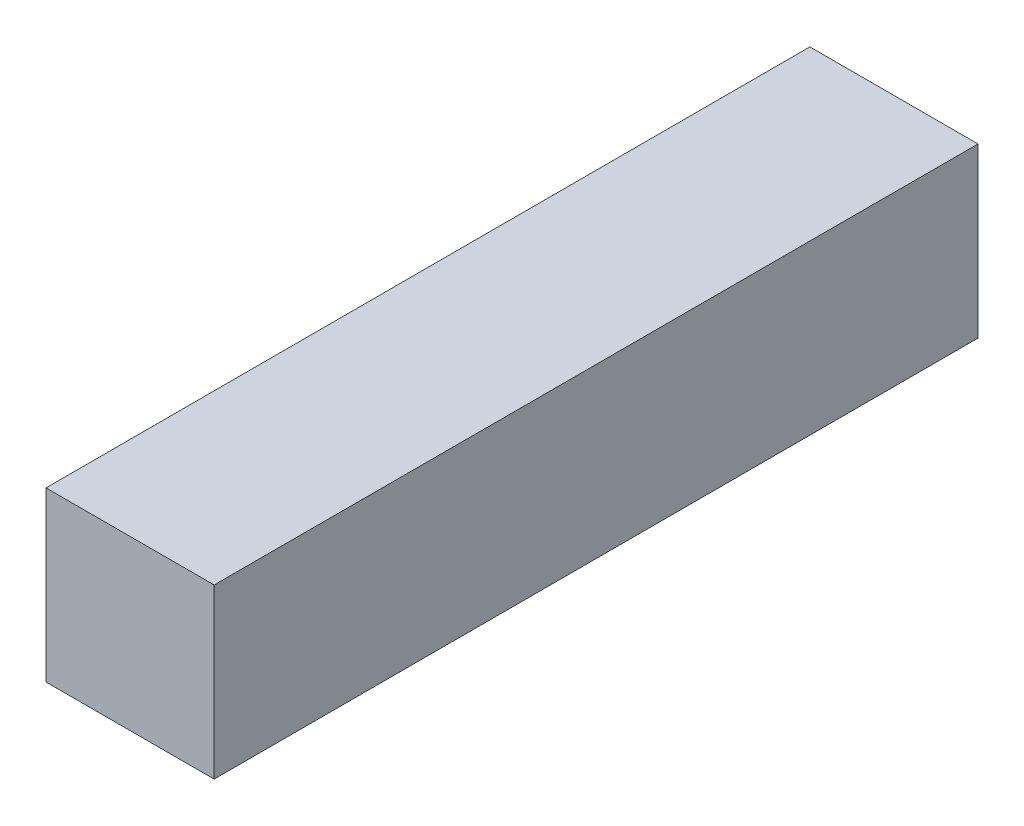
ISO-10303-21;
HEADER;
FILE_DESCRIPTION(('STEP AP214'),'2;1');
FILE_NAME('part.step','',(''),(''),'','','');
FILE_SCHEMA(('AUTOMOTIVE_DESIGN { 1 0 10303 214 1 1 1 1 }'));
ENDSEC;
DATA;
#1=APPLICATION_CONTEXT('core data for automotive mechanical design processes');
#2=APPLICATION_PROTOCOL_DEFINITION('international standard','automotive_design',2000,#1);
#3=PRODUCT_CONTEXT('',#1,'mechanical');
#4=PRODUCT('Part','Part','',(#3));
#5=PRODUCT_RELATED_PRODUCT_CATEGORY('part','',(#4));
#6=PRODUCT_DEFINITION_FORMATION('','',#4);
#7=PRODUCT_DEFINITION_CONTEXT('part definition',#1,'design');
#8=PRODUCT_DEFINITION('design','',#6,#7);
#9=PRODUCT_DEFINITION_SHAPE('','',#8);
#10=(LENGTH_UNIT() NAMED_UNIT(*) SI_UNIT(.MILLI.,.METRE.));
#11=(NAMED_UNIT(*) PLANE_ANGLE_UNIT() SI_UNIT($,.RADIAN.));
#12=(NAMED_UNIT(*) SI_UNIT($,.STERADIAN.) SOLID_ANGLE_UNIT());
#13=UNCERTAINTY_MEASURE_WITH_UNIT(LENGTH_MEASURE(1.E-05),#10,'distance_accuracy_value','');
#14=(GEOMETRIC_REPRESENTATION_CONTEXT(3) GLOBAL_UNCERTAINTY_ASSIGNED_CONTEXT((#13)) GLOBAL_UNIT_ASSIGNED_CONTEXT((#10,
#11,#12)) REPRESENTATION_CONTEXT('',''));
#15=CARTESIAN_POINT('',(0.,0.,0.));
#16=DIRECTION('',(0.,0.,1.));
#17=DIRECTION('',(1.,0.,0.));
#18=AXIS2_PLACEMENT_3D('',#15,#16,#17);
#19=CARTESIAN_POINT('',(-6.99999999998829,7.0000000000016,-41.6994949366046));
#20=DIRECTION('',(-1.,0.,0.));
#21=DIRECTION('',(0.,0.,1.));
#22=AXIS2_PLACEMENT_3D('',#19,#20,#21);
#23=PLANE('',#22);
#24=DIRECTION('',(0.,1.,0.));
#25=VECTOR('',#24,1.);
#26=CARTESIAN_POINT('',(-6.99999999998829,7.0000000000016,-31.8));
#27=LINE('',#26,#25);
#28=CARTESIAN_POINT('',(-6.99999999998829,0.,-31.8));
#29=VERTEX_POINT('',#28);
#30=CARTESIAN_POINT('',(-6.99999999998829,7.0000000000016,-31.8));
#31=VERTEX_POINT('',#30);
#32=EDGE_CURVE('E43',#29,#31,#27,.T.);
#33=ORIENTED_EDGE('',*,*,#32,.F.);
#34=DIRECTION('',(0.,0.,1.));
#35=VECTOR('',#34,1.);
#36=CARTESIAN_POINT('',(-6.99999999998829,0.,-41.6994949366046));
#37=LINE('',#36,#35);
#38=CARTESIAN_POINT('',(-6.99999999998829,0.,0.));
#39=VERTEX_POINT('',#38);
#40=EDGE_CURVE('E71',#29,#39,#37,.T.);
#41=ORIENTED_EDGE('',*,*,#40,.T.);
#42=DIRECTION('',(0.,-1.,0.));
#43=VECTOR('',#42,1.);
#44=CARTESIAN_POINT('',(-6.99999999998829,7.0000000000016,0.));
#45=LINE('',#44,#43);
#46=CARTESIAN_POINT('',(-6.99999999998829,7.0000000000016,0.));
#47=VERTEX_POINT('',#46);
#48=EDGE_CURVE('E75',#47,#39,#45,.T.);
#49=ORIENTED_EDGE('',*,*,#48,.F.);
#50=DIRECTION('',(0.,0.,1.));
#51=VECTOR('',#50,1.);
#52=CARTESIAN_POINT('',(-6.99999999998829,7.0000000000016,-41.6994949366046));
#53=LINE('',#52,#51);
#54=EDGE_CURVE('E98',#31,#47,#53,.T.);
#55=ORIENTED_EDGE('',*,*,#54,.F.);
#56=EDGE_LOOP('',(#33,#41,#49,#55));
#57=FACE_BOUND('',#56,.T.);
#58=ADVANCED_FACE('F35',(#57),#23,.T.);
#59=CARTESIAN_POINT('',(-6.99999999998829,7.0000000000016,-41.6994949366046));
#60=DIRECTION('',(0.,1.,0.));
#61=DIRECTION('',(0.,0.,1.));
#62=AXIS2_PLACEMENT_3D('',#59,#60,#61);
#63=PLANE('',#62);
#64=DIRECTION('',(1.,0.,0.));
#65=VECTOR('',#64,1.);
#66=CARTESIAN_POINT('',(-6.99999999998829,7.0000000000016,-31.8));
#67=LINE('',#66,#65);
#68=CARTESIAN_POINT('',(0.,7.0000000000016,-31.8));
#69=VERTEX_POINT('',#68);
#70=EDGE_CURVE('E49',#31,#69,#67,.T.);
#71=ORIENTED_EDGE('',*,*,#70,.F.);
#72=ORIENTED_EDGE('',*,*,#54,.T.);
#73=DIRECTION('',(-1.,0.,0.));
#74=VECTOR('',#73,1.);
#75=CARTESIAN_POINT('',(-6.99999999998829,7.0000000000016,0.));
#76=LINE('',#75,#74);
#77=CARTESIAN_POINT('',(0.,7.0000000000016,0.));
#78=VERTEX_POINT('',#77);
#79=EDGE_CURVE('E80',#78,#47,#76,.T.);
#80=ORIENTED_EDGE('',*,*,#79,.F.);
#81=DIRECTION('',(0.,0.,1.));
#82=VECTOR('',#81,1.);
#83=CARTESIAN_POINT('',(0.,7.0000000000016,-41.6994949366046));
#84=LINE('',#83,#82);
#85=EDGE_CURVE('E101',#69,#78,#84,.T.);
#86=ORIENTED_EDGE('',*,*,#85,.F.);
#87=EDGE_LOOP('',(#71,#72,#80,#86));
#88=FACE_BOUND('',#87,.T.);
#89=ADVANCED_FACE('F107',(#88),#63,.T.);
#90=CARTESIAN_POINT('',(0.,7.0000000000016,-41.6994949366046));
#91=DIRECTION('',(1.,0.,0.));
#92=DIRECTION('',(0.,0.,-1.));
#93=AXIS2_PLACEMENT_3D('',#90,#91,#92);
#94=PLANE('',#93);
#95=DIRECTION('',(0.,-1.,0.));
#96=VECTOR('',#95,1.);
#97=CARTESIAN_POINT('',(0.,7.0000000000016,-31.8));
#98=LINE('',#97,#96);
#99=CARTESIAN_POINT('',(0.,0.,-31.8));
#100=VERTEX_POINT('',#99);
#101=EDGE_CURVE('E100',#69,#100,#98,.T.);
#102=ORIENTED_EDGE('',*,*,#101,.F.);
#103=ORIENTED_EDGE('',*,*,#85,.T.);
#104=DIRECTION('',(0.,1.,0.));
#105=VECTOR('',#104,1.);
#106=CARTESIAN_POINT('',(0.,7.0000000000016,0.));
#107=LINE('',#106,#105);
#108=CARTESIAN_POINT('',(0.,0.,0.));
#109=VERTEX_POINT('',#108);
#110=EDGE_CURVE('E88',#109,#78,#107,.T.);
#111=ORIENTED_EDGE('',*,*,#110,.F.);
#112=DIRECTION('',(0.,0.,1.));
#113=VECTOR('',#112,1.);
#114=CARTESIAN_POINT('',(0.,0.,-41.6994949366046));
#115=LINE('',#114,#113);
#116=EDGE_CURVE('E79',#100,#109,#115,.T.);
#117=ORIENTED_EDGE('',*,*,#116,.F.);
#118=EDGE_LOOP('',(#102,#103,#111,#117));
#119=FACE_BOUND('',#118,.T.);
#120=ADVANCED_FACE('F105',(#119),#94,.T.);
#121=CARTESIAN_POINT('',(-6.99999999998829,0.,-41.6994949366046));
#122=DIRECTION('',(0.,-1.,0.));
#123=DIRECTION('',(0.,0.,-1.));
#124=AXIS2_PLACEMENT_3D('',#121,#122,#123);
#125=PLANE('',#124);
#126=DIRECTION('',(-1.,0.,0.));
#127=VECTOR('',#126,1.);
#128=CARTESIAN_POINT('',(-6.99999999998829,0.,-31.8));
#129=LINE('',#128,#127);
#130=EDGE_CURVE('E11',#100,#29,#129,.T.);
#131=ORIENTED_EDGE('',*,*,#130,.F.);
#132=ORIENTED_EDGE('',*,*,#116,.T.);
#133=DIRECTION('',(1.,0.,0.));
#134=VECTOR('',#133,1.);
#135=CARTESIAN_POINT('',(-6.99999999998829,0.,0.));
#136=LINE('',#135,#134);
#137=EDGE_CURVE('E82',#39,#109,#136,.T.);
#138=ORIENTED_EDGE('',*,*,#137,.F.);
#139=ORIENTED_EDGE('',*,*,#40,.F.);
#140=EDGE_LOOP('',(#131,#132,#138,#139));
#141=FACE_BOUND('',#140,.T.);
#142=ADVANCED_FACE('F83',(#141),#125,.T.);
#143=CARTESIAN_POINT('',(0.,0.,0.));
#144=DIRECTION('',(0.,0.,1.));
#145=DIRECTION('',(1.,0.,0.));
#146=AXIS2_PLACEMENT_3D('',#143,#144,#145);
#147=PLANE('',#146);
#148=ORIENTED_EDGE('',*,*,#48,.T.);
#149=ORIENTED_EDGE('',*,*,#137,.T.);
#150=ORIENTED_EDGE('',*,*,#110,.T.);
#151=ORIENTED_EDGE('',*,*,#79,.T.);
#152=EDGE_LOOP('',(#148,#149,#150,#151));
#153=FACE_BOUND('',#152,.T.);
#154=ADVANCED_FACE('F90',(#153),#147,.T.);
#155=CARTESIAN_POINT('',(-3.49999999999984,3.50000000000001,-31.8));
#156=DIRECTION('',(0.,0.,1.));
#157=DIRECTION('',(1.,0.,0.));
#158=AXIS2_PLACEMENT_3D('',#155,#156,#157);
#159=PLANE('',#158);
#160=ORIENTED_EDGE('',*,*,#32,.T.);
#161=ORIENTED_EDGE('',*,*,#70,.T.);
#162=ORIENTED_EDGE('',*,*,#101,.T.);
#163=ORIENTED_EDGE('',*,*,#130,.T.);
#164=EDGE_LOOP('',(#160,#161,#162,#163));
#165=FACE_BOUND('',#164,.T.);
#166=ADVANCED_FACE('F109',(#165),#159,.F.);
#167=CLOSED_SHELL('',(#58,#89,#120,#142,#154,#166));
#168=MANIFOLD_SOLID_BREP('B2',#167);
#169=ADVANCED_BREP_SHAPE_REPRESENTATION('',(#18,#168),#14);
#170=SHAPE_DEFINITION_REPRESENTATION(#9,#169);
ENDSEC;
END-ISO-10303-21;
